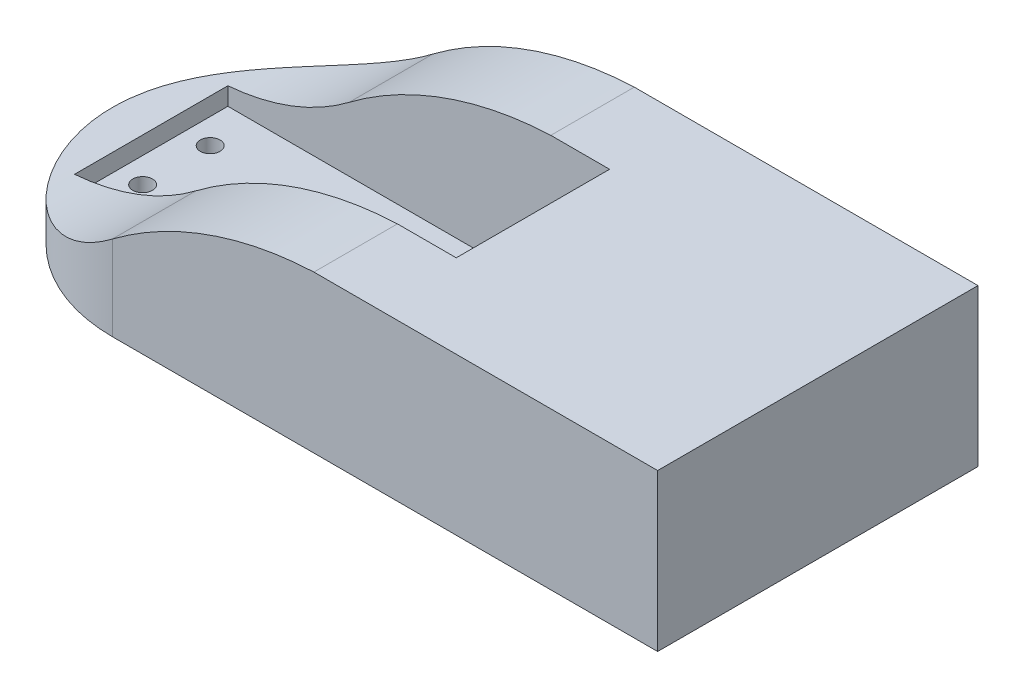
ISO-10303-21;
HEADER;
FILE_DESCRIPTION(('STEP AP214'),'2;1');
FILE_NAME('part.step','',(''),(''),'','','');
FILE_SCHEMA(('AUTOMOTIVE_DESIGN { 1 0 10303 214 1 1 1 1 }'));
ENDSEC;
DATA;
#1=APPLICATION_CONTEXT('core data for automotive mechanical design processes');
#2=APPLICATION_PROTOCOL_DEFINITION('international standard','automotive_design',2000,#1);
#3=PRODUCT_CONTEXT('',#1,'mechanical');
#4=PRODUCT('Part','Part','',(#3));
#5=PRODUCT_RELATED_PRODUCT_CATEGORY('part','',(#4));
#6=PRODUCT_DEFINITION_FORMATION('','',#4);
#7=PRODUCT_DEFINITION_CONTEXT('part definition',#1,'design');
#8=PRODUCT_DEFINITION('design','',#6,#7);
#9=PRODUCT_DEFINITION_SHAPE('','',#8);
#10=(LENGTH_UNIT() NAMED_UNIT(*) SI_UNIT(.MILLI.,.METRE.));
#11=(NAMED_UNIT(*) PLANE_ANGLE_UNIT() SI_UNIT($,.RADIAN.));
#12=(NAMED_UNIT(*) SI_UNIT($,.STERADIAN.) SOLID_ANGLE_UNIT());
#13=UNCERTAINTY_MEASURE_WITH_UNIT(LENGTH_MEASURE(1.E-05),#10,'distance_accuracy_value','');
#14=(GEOMETRIC_REPRESENTATION_CONTEXT(3) GLOBAL_UNCERTAINTY_ASSIGNED_CONTEXT((#13)) GLOBAL_UNIT_ASSIGNED_CONTEXT((#10,
#11,#12)) REPRESENTATION_CONTEXT('',''));
#15=CARTESIAN_POINT('',(0.,0.,0.));
#16=DIRECTION('',(0.,0.,1.));
#17=DIRECTION('',(1.,0.,0.));
#18=AXIS2_PLACEMENT_3D('',#15,#16,#17);
#19=CARTESIAN_POINT('',(0.,0.,0.));
#20=DIRECTION('',(0.,1.,0.));
#21=DIRECTION('',(0.,0.,1.));
#22=AXIS2_PLACEMENT_3D('',#19,#20,#21);
#23=PLANE('',#22);
#24=CARTESIAN_POINT('',(-14.1003752376238,0.,-4.95323736700255));
#25=DIRECTION('',(0.,1.,0.));
#26=DIRECTION('',(0.,0.,1.));
#27=AXIS2_PLACEMENT_3D('',#24,#25,#26);
#28=CIRCLE('',#27,1.45);
#29=CARTESIAN_POINT('',(-14.1003752376238,0.,-3.50323736700255));
#30=VERTEX_POINT('',#29);
#31=EDGE_CURVE('E332',#30,#30,#28,.T.);
#32=ORIENTED_EDGE('',*,*,#31,.T.);
#33=EDGE_LOOP('',(#32));
#34=FACE_BOUND('',#33,.T.);
#35=CARTESIAN_POINT('',(-14.1003752376238,0.,4.95625504727173));
#36=DIRECTION('',(0.,1.,0.));
#37=DIRECTION('',(0.,0.,1.));
#38=AXIS2_PLACEMENT_3D('',#35,#36,#37);
#39=CIRCLE('',#38,1.45);
#40=CARTESIAN_POINT('',(-14.1003752376238,0.,6.40625504727173));
#41=VERTEX_POINT('',#40);
#42=EDGE_CURVE('E326',#41,#41,#39,.T.);
#43=ORIENTED_EDGE('',*,*,#42,.T.);
#44=EDGE_LOOP('',(#43));
#45=FACE_BOUND('',#44,.T.);
#46=CARTESIAN_POINT('',(34.5,0.,4.94999999999989));
#47=DIRECTION('',(0.,1.,0.));
#48=DIRECTION('',(0.,0.,1.));
#49=AXIS2_PLACEMENT_3D('',#46,#47,#48);
#50=CIRCLE('',#49,1.45);
#51=CARTESIAN_POINT('',(34.5,0.,6.39999999999989));
#52=VERTEX_POINT('',#51);
#53=EDGE_CURVE('E320',#52,#52,#50,.T.);
#54=ORIENTED_EDGE('',*,*,#53,.T.);
#55=EDGE_LOOP('',(#54));
#56=FACE_BOUND('',#55,.T.);
#57=CARTESIAN_POINT('',(34.5,0.,-4.95323736700255));
#58=DIRECTION('',(0.,1.,0.));
#59=DIRECTION('',(0.,0.,1.));
#60=AXIS2_PLACEMENT_3D('',#57,#58,#59);
#61=CIRCLE('',#60,1.45);
#62=CARTESIAN_POINT('',(34.5,0.,-3.50323736700255));
#63=VERTEX_POINT('',#62);
#64=EDGE_CURVE('E313',#63,#63,#61,.T.);
#65=ORIENTED_EDGE('',*,*,#64,.T.);
#66=EDGE_LOOP('',(#65));
#67=FACE_BOUND('',#66,.T.);
#68=CARTESIAN_POINT('',(0.,0.,0.));
#69=DIRECTION('',(0.,1.,0.));
#70=DIRECTION('',(0.,0.,1.));
#71=AXIS2_PLACEMENT_3D('',#68,#69,#70);
#72=CIRCLE('',#71,23.5);
#73=CARTESIAN_POINT('',(0.,0.,-23.5));
#74=VERTEX_POINT('',#73);
#75=CARTESIAN_POINT('',(0.,0.,23.5));
#76=VERTEX_POINT('',#75);
#77=EDGE_CURVE('E128',#74,#76,#72,.T.);
#78=ORIENTED_EDGE('',*,*,#77,.F.);
#79=DIRECTION('',(1.,0.,0.));
#80=VECTOR('',#79,1.);
#81=CARTESIAN_POINT('',(0.,0.,-23.5));
#82=LINE('',#81,#80);
#83=CARTESIAN_POINT('',(80.,0.,-23.5));
#84=VERTEX_POINT('',#83);
#85=EDGE_CURVE('E110',#74,#84,#82,.T.);
#86=ORIENTED_EDGE('',*,*,#85,.T.);
#87=DIRECTION('',(0.,0.,1.));
#88=VECTOR('',#87,1.);
#89=CARTESIAN_POINT('',(80.,0.,-23.5));
#90=LINE('',#89,#88);
#91=CARTESIAN_POINT('',(80.,0.,23.5));
#92=VERTEX_POINT('',#91);
#93=EDGE_CURVE('E120',#84,#92,#90,.T.);
#94=ORIENTED_EDGE('',*,*,#93,.T.);
#95=DIRECTION('',(1.,0.,0.));
#96=VECTOR('',#95,1.);
#97=CARTESIAN_POINT('',(0.,0.,23.5));
#98=LINE('',#97,#96);
#99=EDGE_CURVE('E126',#76,#92,#98,.T.);
#100=ORIENTED_EDGE('',*,*,#99,.F.);
#101=EDGE_LOOP('',(#78,#86,#94,#100));
#102=FACE_BOUND('',#101,.T.);
#103=ADVANCED_FACE('F62',(#34,#45,#56,#67,#102),#23,.F.);
#104=CARTESIAN_POINT('',(0.,23.,0.));
#105=DIRECTION('',(0.,1.,0.));
#106=DIRECTION('',(0.,0.,1.));
#107=AXIS2_PLACEMENT_3D('',#104,#105,#106);
#108=PLANE('',#107);
#109=DIRECTION('',(0.,0.,1.));
#110=VECTOR('',#109,1.);
#111=CARTESIAN_POINT('',(29.574214856324,23.,-23.5));
#112=LINE('',#111,#110);
#113=CARTESIAN_POINT('',(29.574214856324,23.,11.2500000000001));
#114=VERTEX_POINT('',#113);
#115=CARTESIAN_POINT('',(29.574214856324,23.,23.5));
#116=VERTEX_POINT('',#115);
#117=EDGE_CURVE('E300',#114,#116,#112,.T.);
#118=ORIENTED_EDGE('',*,*,#117,.T.);
#119=DIRECTION('',(1.,0.,0.));
#120=VECTOR('',#119,1.);
#121=CARTESIAN_POINT('',(0.,23.,23.5));
#122=LINE('',#121,#120);
#123=CARTESIAN_POINT('',(80.,23.,23.5));
#124=VERTEX_POINT('',#123);
#125=EDGE_CURVE('E129',#116,#124,#122,.T.);
#126=ORIENTED_EDGE('',*,*,#125,.T.);
#127=DIRECTION('',(0.,0.,1.));
#128=VECTOR('',#127,1.);
#129=CARTESIAN_POINT('',(80.,23.,-23.5));
#130=LINE('',#129,#128);
#131=CARTESIAN_POINT('',(80.,23.,-23.5));
#132=VERTEX_POINT('',#131);
#133=EDGE_CURVE('E131',#132,#124,#130,.T.);
#134=ORIENTED_EDGE('',*,*,#133,.F.);
#135=DIRECTION('',(1.,0.,0.));
#136=VECTOR('',#135,1.);
#137=CARTESIAN_POINT('',(0.,23.,-23.5));
#138=LINE('',#137,#136);
#139=CARTESIAN_POINT('',(29.574214856324,23.,-23.5));
#140=VERTEX_POINT('',#139);
#141=EDGE_CURVE('E113',#140,#132,#138,.T.);
#142=ORIENTED_EDGE('',*,*,#141,.F.);
#143=CARTESIAN_POINT('',(29.574214856324,23.,-11.2500000000007));
#144=VERTEX_POINT('',#143);
#145=EDGE_CURVE('E302',#140,#144,#112,.T.);
#146=ORIENTED_EDGE('',*,*,#145,.T.);
#147=DIRECTION('',(-1.,0.,0.));
#148=VECTOR('',#147,1.);
#149=CARTESIAN_POINT('',(-17.8,23.,-11.250000000001));
#150=LINE('',#149,#148);
#151=CARTESIAN_POINT('',(38.2000000000001,23.,-11.2500000000004));
#152=VERTEX_POINT('',#151);
#153=EDGE_CURVE('E233',#152,#144,#150,.T.);
#154=ORIENTED_EDGE('',*,*,#153,.F.);
#155=DIRECTION('',(0.,0.,-1.));
#156=VECTOR('',#155,1.);
#157=CARTESIAN_POINT('',(38.2000000000001,23.,-11.2500000000004));
#158=LINE('',#157,#156);
#159=CARTESIAN_POINT('',(38.2000000000002,23.,11.2499999999999));
#160=VERTEX_POINT('',#159);
#161=EDGE_CURVE('E222',#160,#152,#158,.T.);
#162=ORIENTED_EDGE('',*,*,#161,.F.);
#163=DIRECTION('',(1.,0.,0.));
#164=VECTOR('',#163,1.);
#165=CARTESIAN_POINT('',(38.2000000000002,23.,11.2499999999999));
#166=LINE('',#165,#164);
#167=EDGE_CURVE('E232',#114,#160,#166,.T.);
#168=ORIENTED_EDGE('',*,*,#167,.F.);
#169=EDGE_LOOP('',(#118,#126,#134,#142,#146,#154,#162,#168));
#170=FACE_BOUND('',#169,.T.);
#171=ADVANCED_FACE('F277',(#170),#108,.T.);
#172=CARTESIAN_POINT('',(0.,23.,0.));
#173=DIRECTION('',(0.,-1.,0.));
#174=DIRECTION('',(0.,0.,-1.));
#175=AXIS2_PLACEMENT_3D('',#172,#173,#174);
#176=CYLINDRICAL_SURFACE('',#175,23.5);
#177=DIRECTION('',(0.,-1.,0.));
#178=VECTOR('',#177,1.);
#179=CARTESIAN_POINT('',(0.,23.,23.5));
#180=LINE('',#179,#178);
#181=CARTESIAN_POINT('',(0.,12.4092035172536,23.5));
#182=VERTEX_POINT('',#181);
#183=EDGE_CURVE('E135',#182,#76,#180,.T.);
#184=ORIENTED_EDGE('',*,*,#183,.F.);
#185=CARTESIAN_POINT('',(0.,12.4092035172536,23.5));
#186=CARTESIAN_POINT('',(-0.244052644575949,12.2239857633566,23.4999995457922));
#187=CARTESIAN_POINT('',(-0.490597991677809,12.042088966713,23.4961973453588));
#188=CARTESIAN_POINT('',(-0.988373755156162,11.6851323295406,23.4805271315603));
#189=CARTESIAN_POINT('',(-1.2396046489349,11.5100731913739,23.4686582918846));
#190=CARTESIAN_POINT('',(-2.00005426237437,10.9953281948611,23.4202430513505));
#191=CARTESIAN_POINT('',(-2.51578359936776,10.666261626987,23.370886995028));
#192=CARTESIAN_POINT('',(-3.56145807596274,10.0379507062078,23.2345540440406));
#193=CARTESIAN_POINT('',(-4.09142551118063,9.7387570581557,23.1475144795817));
#194=CARTESIAN_POINT('',(-5.16010152646308,9.17239327367803,22.9329504447906));
#195=CARTESIAN_POINT('',(-5.69880779587703,8.90521482384704,22.8054365159792));
#196=CARTESIAN_POINT('',(-6.78249144509834,8.40260767245476,22.5070030179749));
#197=CARTESIAN_POINT('',(-7.32748666380046,8.16734255239274,22.3358718700244));
#198=CARTESIAN_POINT('',(-8.41529279103563,7.73047972341131,21.9491695664871));
#199=CARTESIAN_POINT('',(-8.9581035081735,7.52888490443356,21.7335945998058));
#200=CARTESIAN_POINT('',(-10.0343273539135,7.15929750443181,21.2581205467449));
#201=CARTESIAN_POINT('',(-10.5677565361966,6.9912410994123,20.9983074273218));
#202=CARTESIAN_POINT('',(-11.6202189372866,6.68695594137842,20.4346956547464));
#203=CARTESIAN_POINT('',(-12.1392530898467,6.55072511967864,20.1308998625791));
#204=CARTESIAN_POINT('',(-13.1233359827985,6.31605383128535,19.5024597445631));
#205=CARTESIAN_POINT('',(-13.5896789618178,6.21570210969996,19.1805473102));
#206=CARTESIAN_POINT('',(-14.5006319097206,6.0386295577361,18.5014700872519));
#207=CARTESIAN_POINT('',(-14.9452427914974,5.96190773402492,18.1443067813456));
#208=CARTESIAN_POINT('',(-15.8093957355904,5.82939158356437,17.3965459020244));
#209=CARTESIAN_POINT('',(-16.2289148118754,5.77361620578775,17.0059184460033));
#210=CARTESIAN_POINT('',(-17.0392374705673,5.6801785212823,16.1939316096182));
#211=CARTESIAN_POINT('',(-17.430039813033,5.64251699629089,15.7725709038066));
#212=CARTESIAN_POINT('',(-18.1943945917157,5.58112964951433,14.8852200643244));
#213=CARTESIAN_POINT('',(-18.5667326437263,5.55798582329973,14.4181439224485));
#214=CARTESIAN_POINT('',(-19.2749444658622,5.52452844366282,13.4567098625482));
#215=CARTESIAN_POINT('',(-19.6108176715048,5.51421508883283,12.9623515223688));
#216=CARTESIAN_POINT('',(-20.2439772828285,5.50310820639031,11.949399101556));
#217=CARTESIAN_POINT('',(-20.5412622128209,5.50231504274185,11.4308040950974));
#218=CARTESIAN_POINT('',(-21.0954540776294,5.50714014613263,10.3724951174585));
#219=CARTESIAN_POINT('',(-21.3523592998431,5.51275868502443,9.83278025174513));
#220=CARTESIAN_POINT('',(-21.8432082173504,5.52817088531594,8.69139932155585));
#221=CARTESIAN_POINT('',(-22.0736637164661,5.53826295971864,8.08823403874654));
#222=CARTESIAN_POINT('',(-22.484175661718,5.55952678664426,6.86499136421877));
#223=CARTESIAN_POINT('',(-22.6642296861945,5.57069859101071,6.2449131614489));
#224=CARTESIAN_POINT('',(-22.9727410055273,5.59160840398454,4.99194165137468));
#225=CARTESIAN_POINT('',(-23.1011920585437,5.60134623905035,4.35904680350241));
#226=CARTESIAN_POINT('',(-23.3055876859054,5.61753607725399,3.08479587015623));
#227=CARTESIAN_POINT('',(-23.3815323143304,5.62398808377611,2.44343979339778));
#228=CARTESIAN_POINT('',(-23.4815499007328,5.63258662174588,1.14149450616259));
#229=CARTESIAN_POINT('',(-23.5043625717932,5.6346284644245,0.480807380510978));
#230=CARTESIAN_POINT('',(-23.4942637393949,5.63373984543253,-0.84014686057953));
#231=CARTESIAN_POINT('',(-23.4613510764391,5.63080928029926,-1.50041396699297));
#232=CARTESIAN_POINT('',(-23.3400368659146,5.62048809728251,-2.81584444414135));
#233=CARTESIAN_POINT('',(-23.2516311397023,5.61309714353211,-3.47100742677273));
#234=CARTESIAN_POINT('',(-23.0199673454929,5.59521326195164,-4.77151485860004));
#235=CARTESIAN_POINT('',(-22.8767094293147,5.58472034270716,-5.41685933496634));
#236=CARTESIAN_POINT('',(-22.5367459403205,5.56280716160676,-6.69173569443185));
#237=CARTESIAN_POINT('',(-22.3401615713242,5.55138904338021,-7.32129994162066));
#238=CARTESIAN_POINT('',(-21.8947763024631,5.53044506866777,-8.56171838935722));
#239=CARTESIAN_POINT('',(-21.6459751639504,5.52091922083056,-9.17257250437884));
#240=CARTESIAN_POINT('',(-21.097836521898,5.50720512588301,-10.3713923589628));
#241=CARTESIAN_POINT('',(-20.7984888378525,5.50301795548346,-10.9593534582615));
#242=CARTESIAN_POINT('',(-20.1514236305978,5.50393063887138,-12.1080406040605));
#243=CARTESIAN_POINT('',(-19.8037063181084,5.50903045220175,-12.668766769194));
#244=CARTESIAN_POINT('',(-19.0629300602186,5.53282174989347,-13.7582000882515));
#245=CARTESIAN_POINT('',(-18.6699242460123,5.55149744130083,-14.2869436743192));
#246=CARTESIAN_POINT('',(-17.8414055405478,5.60695311096591,-15.3090492506783));
#247=CARTESIAN_POINT('',(-17.4058923981988,5.64373319617143,-15.8024110319395));
#248=CARTESIAN_POINT('',(-16.4965116482134,5.73994613925311,-16.7495013554313));
#249=CARTESIAN_POINT('',(-16.0226677508346,5.79936507654503,-17.2032540428918));
#250=CARTESIAN_POINT('',(-15.0410971440629,5.94526096637331,-18.0677327674196));
#251=CARTESIAN_POINT('',(-14.5333732033237,6.03173571005309,-18.4784623132764));
#252=CARTESIAN_POINT('',(-13.521989972559,6.22939046442161,-19.2296033152978));
#253=CARTESIAN_POINT('',(-13.0200306649007,6.33870615924705,-19.5727957473557));
#254=CARTESIAN_POINT('',(-11.9964634698203,6.58738489902557,-20.2163362011264));
#255=CARTESIAN_POINT('',(-11.4748563903347,6.72674670956237,-20.516685982147));
#256=CARTESIAN_POINT('',(-10.4179423239297,7.03751564172173,-21.07304068772));
#257=CARTESIAN_POINT('',(-9.88263960368225,7.20891288562519,-21.3290592344958));
#258=CARTESIAN_POINT('',(-8.80428637082964,7.58500216872554,-21.7963253740602));
#259=CARTESIAN_POINT('',(-8.26123634011718,7.78969214523803,-22.0075757386401));
#260=CARTESIAN_POINT('',(-7.2108702624353,8.21749561023853,-22.3727742399529));
#261=CARTESIAN_POINT('',(-6.70366165073587,8.43837812988664,-22.5296615176331));
#262=CARTESIAN_POINT('',(-5.6924776429862,8.90900830341335,-22.8061491689884));
#263=CARTESIAN_POINT('',(-5.18850238263215,9.15875716048811,-22.9257479876509));
#264=CARTESIAN_POINT('',(-4.18832494010638,9.68615476753456,-23.1293832068404));
#265=CARTESIAN_POINT('',(-3.69212002652962,9.96379344719434,-23.2134323867359));
#266=CARTESIAN_POINT('',(-2.71119105745704,10.5457411253922,-23.3483288257204));
#267=CARTESIAN_POINT('',(-2.22646335329215,10.8500414994075,-23.3991867768584));
#268=CARTESIAN_POINT('',(-1.45113703294093,11.3646555577611,-23.457056892169));
#269=CARTESIAN_POINT('',(-1.15606491844249,11.5672952438251,-23.4733646553653));
#270=CARTESIAN_POINT('',(-0.572866660613985,11.9815338665914,-23.4948245370496));
#271=CARTESIAN_POINT('',(-0.284726279672556,12.193111437939,-23.5000018765049));
#272=CARTESIAN_POINT('',(0.,12.4092035172536,-23.5));
#273=B_SPLINE_CURVE_WITH_KNOTS('',3,(#185,#186,#187,#188,#189,#190,#191,#192,#193,#194,#195,
#196,#197,#198,#199,#200,#201,#202,#203,#204,#205,#206,#207,#208,#209,#210,#211,#212,#213,#214,
#215,#216,#217,#218,#219,#220,#221,#222,#223,#224,#225,#226,#227,#228,#229,#230,#231,#232,#233,
#234,#235,#236,#237,#238,#239,#240,#241,#242,#243,#244,#245,#246,#247,#248,#249,#250,#251,#252,
#253,#254,#255,#256,#257,#258,#259,#260,#261,#262,#263,#264,#265,#266,#267,#268,#269,#270,#271,
#272),.UNSPECIFIED.,.F.,.F.,(4,2,2,2,2,2,2,2,2,2,2,2,2,2,2,2,2,2,2,2,2,2,2,2,2,2,2,2,2,2,2,2,2,
2,2,2,2,2,2,2,2,2,2,4),(0.,0.919030757575344,1.83815567077144,3.67733058596115,5.5195759727964,
7.36134194122921,9.2122178882149,11.0632526154184,12.910730488269,14.7580882403184,
16.4825363009859,18.2069118609367,19.9328436220555,21.6588498623274,23.4502444998257,
25.2416668645031,27.0331577163899,28.8247245293005,30.7598146031867,32.6949976371596,
34.630414678362,36.56582972615,38.5467047634009,40.5276210179411,42.5086864539377,
44.4897464068108,46.46634086826,48.4429443635979,50.4199464396496,52.3969399032664,
54.3716371837288,56.3463461294305,58.3198427851579,60.293178365142,62.1441570914022,
63.9950597864362,65.8453927177966,67.6956110535746,69.4187511778386,71.1419631513199,
72.8645551377458,74.586591943127,75.6612422254041,76.7334548275522),.UNSPECIFIED.);
#274=CARTESIAN_POINT('',(0.,12.4092035172536,-23.5));
#275=VERTEX_POINT('',#274);
#276=EDGE_CURVE('E165',#182,#275,#273,.T.);
#277=ORIENTED_EDGE('',*,*,#276,.T.);
#278=DIRECTION('',(0.,-1.,0.));
#279=VECTOR('',#278,1.);
#280=CARTESIAN_POINT('',(0.,23.,-23.5));
#281=LINE('',#280,#279);
#282=EDGE_CURVE('E86',#275,#74,#281,.T.);
#283=ORIENTED_EDGE('',*,*,#282,.T.);
#284=ORIENTED_EDGE('',*,*,#77,.T.);
#285=EDGE_LOOP('',(#184,#277,#283,#284));
#286=FACE_BOUND('',#285,.T.);
#287=ADVANCED_FACE('F161',(#286),#176,.T.);
#288=CARTESIAN_POINT('',(80.,23.,-23.5));
#289=DIRECTION('',(1.,0.,0.));
#290=DIRECTION('',(0.,0.,-1.));
#291=AXIS2_PLACEMENT_3D('',#288,#289,#290);
#292=PLANE('',#291);
#293=ORIENTED_EDGE('',*,*,#93,.F.);
#294=DIRECTION('',(0.,-1.,0.));
#295=VECTOR('',#294,1.);
#296=CARTESIAN_POINT('',(80.,23.,-23.5));
#297=LINE('',#296,#295);
#298=EDGE_CURVE('E105',#132,#84,#297,.T.);
#299=ORIENTED_EDGE('',*,*,#298,.F.);
#300=ORIENTED_EDGE('',*,*,#133,.T.);
#301=DIRECTION('',(0.,-1.,0.));
#302=VECTOR('',#301,1.);
#303=CARTESIAN_POINT('',(80.,23.,23.5));
#304=LINE('',#303,#302);
#305=EDGE_CURVE('E117',#124,#92,#304,.T.);
#306=ORIENTED_EDGE('',*,*,#305,.T.);
#307=EDGE_LOOP('',(#293,#299,#300,#306));
#308=FACE_BOUND('',#307,.T.);
#309=ADVANCED_FACE('F121',(#308),#292,.T.);
#310=CARTESIAN_POINT('',(0.,23.,-23.5));
#311=DIRECTION('',(0.,0.,-1.));
#312=DIRECTION('',(-1.,0.,0.));
#313=AXIS2_PLACEMENT_3D('',#310,#311,#312);
#314=PLANE('',#313);
#315=CARTESIAN_POINT('',(31.7758941833863,-29.7356479398533,-23.5));
#316=DIRECTION('',(0.,0.,-1.));
#317=DIRECTION('',(-1.,0.,0.));
#318=AXIS2_PLACEMENT_3D('',#315,#316,#317);
#319=CIRCLE('',#318,52.7815872771497);
#320=EDGE_CURVE('E303',#275,#140,#319,.T.);
#321=ORIENTED_EDGE('',*,*,#320,.T.);
#322=ORIENTED_EDGE('',*,*,#141,.T.);
#323=ORIENTED_EDGE('',*,*,#298,.T.);
#324=ORIENTED_EDGE('',*,*,#85,.F.);
#325=ORIENTED_EDGE('',*,*,#282,.F.);
#326=EDGE_LOOP('',(#321,#322,#323,#324,#325));
#327=FACE_BOUND('',#326,.T.);
#328=ADVANCED_FACE('F108',(#327),#314,.T.);
#329=CARTESIAN_POINT('',(0.,23.,23.5));
#330=DIRECTION('',(0.,0.,-1.));
#331=DIRECTION('',(-1.,0.,0.));
#332=AXIS2_PLACEMENT_3D('',#329,#330,#331);
#333=PLANE('',#332);
#334=ORIENTED_EDGE('',*,*,#125,.F.);
#335=CARTESIAN_POINT('',(31.7758941833863,-29.7356479398533,23.5));
#336=DIRECTION('',(0.,0.,-1.));
#337=DIRECTION('',(-1.,0.,0.));
#338=AXIS2_PLACEMENT_3D('',#335,#336,#337);
#339=CIRCLE('',#338,52.7815872771497);
#340=EDGE_CURVE('E298',#182,#116,#339,.T.);
#341=ORIENTED_EDGE('',*,*,#340,.F.);
#342=ORIENTED_EDGE('',*,*,#183,.T.);
#343=ORIENTED_EDGE('',*,*,#99,.T.);
#344=ORIENTED_EDGE('',*,*,#305,.F.);
#345=EDGE_LOOP('',(#334,#341,#342,#343,#344));
#346=FACE_BOUND('',#345,.T.);
#347=ADVANCED_FACE('F64',(#346),#333,.F.);
#348=CARTESIAN_POINT('',(-17.8,-60.3510563287841,-11.250000000001));
#349=DIRECTION('',(0.,0.,-1.));
#350=DIRECTION('',(-1.,0.,0.));
#351=AXIS2_PLACEMENT_3D('',#348,#349,#350);
#352=PLANE('',#351);
#353=ORIENTED_EDGE('',*,*,#153,.T.);
#354=CARTESIAN_POINT('',(31.7758941833863,-29.7356479398533,-11.2500000000005));
#355=DIRECTION('',(0.,0.,-1.));
#356=DIRECTION('',(-1.,0.,0.));
#357=AXIS2_PLACEMENT_3D('',#354,#355,#356);
#358=CIRCLE('',#357,52.7815872771497);
#359=CARTESIAN_POINT('',(0.,12.4092035172536,-11.2500000000014));
#360=VERTEX_POINT('',#359);
#361=EDGE_CURVE('E235',#144,#360,#358,.F.);
#362=ORIENTED_EDGE('',*,*,#361,.T.);
#363=CARTESIAN_POINT('',(-20.5227613376453,39.4514129373195,-11.250000000001));
#364=DIRECTION('',(0.,0.,-1.));
#365=DIRECTION('',(-1.,0.,0.));
#366=AXIS2_PLACEMENT_3D('',#363,#364,#365);
#367=CIRCLE('',#366,33.9479722993973);
#368=CARTESIAN_POINT('',(-17.8,5.61280489947504,-11.250000000001));
#369=VERTEX_POINT('',#368);
#370=EDGE_CURVE('E247',#360,#369,#367,.T.);
#371=ORIENTED_EDGE('',*,*,#370,.T.);
#372=DIRECTION('',(0.,1.,0.));
#373=VECTOR('',#372,1.);
#374=CARTESIAN_POINT('',(-17.8,-60.3510563287841,-11.250000000001));
#375=LINE('',#374,#373);
#376=CARTESIAN_POINT('',(-17.8,3.,-11.250000000001));
#377=VERTEX_POINT('',#376);
#378=EDGE_CURVE('E159',#377,#369,#375,.T.);
#379=ORIENTED_EDGE('',*,*,#378,.F.);
#380=DIRECTION('',(1.,0.,0.));
#381=VECTOR('',#380,1.);
#382=CARTESIAN_POINT('',(-17.8,3.,-11.250000000001));
#383=LINE('',#382,#381);
#384=CARTESIAN_POINT('',(38.2000000000001,3.,-11.2500000000004));
#385=VERTEX_POINT('',#384);
#386=EDGE_CURVE('E150',#377,#385,#383,.T.);
#387=ORIENTED_EDGE('',*,*,#386,.T.);
#388=DIRECTION('',(0.,1.,0.));
#389=VECTOR('',#388,1.);
#390=CARTESIAN_POINT('',(38.2000000000001,-60.3510563287841,-11.2500000000004));
#391=LINE('',#390,#389);
#392=EDGE_CURVE('E209',#385,#152,#391,.T.);
#393=ORIENTED_EDGE('',*,*,#392,.T.);
#394=EDGE_LOOP('',(#353,#362,#371,#379,#387,#393));
#395=FACE_BOUND('',#394,.T.);
#396=ADVANCED_FACE('F207',(#395),#352,.F.);
#397=CARTESIAN_POINT('',(38.2000000000001,-60.3510563287841,-11.2500000000004));
#398=DIRECTION('',(1.,0.,0.));
#399=DIRECTION('',(0.,0.,-1.));
#400=AXIS2_PLACEMENT_3D('',#397,#398,#399);
#401=PLANE('',#400);
#402=DIRECTION('',(0.,0.,1.));
#403=VECTOR('',#402,1.);
#404=CARTESIAN_POINT('',(38.2000000000001,3.,-11.2500000000004));
#405=LINE('',#404,#403);
#406=CARTESIAN_POINT('',(38.2000000000002,3.,11.2499999999999));
#407=VERTEX_POINT('',#406);
#408=EDGE_CURVE('E156',#385,#407,#405,.T.);
#409=ORIENTED_EDGE('',*,*,#408,.T.);
#410=DIRECTION('',(0.,1.,0.));
#411=VECTOR('',#410,1.);
#412=CARTESIAN_POINT('',(38.2000000000002,-60.3510563287841,11.2499999999999));
#413=LINE('',#412,#411);
#414=EDGE_CURVE('E224',#407,#160,#413,.T.);
#415=ORIENTED_EDGE('',*,*,#414,.T.);
#416=ORIENTED_EDGE('',*,*,#161,.T.);
#417=ORIENTED_EDGE('',*,*,#392,.F.);
#418=EDGE_LOOP('',(#409,#415,#416,#417));
#419=FACE_BOUND('',#418,.T.);
#420=ADVANCED_FACE('F220',(#419),#401,.F.);
#421=CARTESIAN_POINT('',(38.2000000000002,-60.3510563287841,11.2499999999999));
#422=DIRECTION('',(0.,0.,1.));
#423=DIRECTION('',(1.,0.,0.));
#424=AXIS2_PLACEMENT_3D('',#421,#422,#423);
#425=PLANE('',#424);
#426=CARTESIAN_POINT('',(-20.5227613376453,39.4514129373195,11.2500000000002));
#427=DIRECTION('',(0.,0.,1.));
#428=DIRECTION('',(1.,0.,0.));
#429=AXIS2_PLACEMENT_3D('',#426,#427,#428);
#430=CIRCLE('',#429,33.9479722993973);
#431=CARTESIAN_POINT('',(-17.8,5.61280489947504,11.2500000000001));
#432=VERTEX_POINT('',#431);
#433=CARTESIAN_POINT('',(0.,12.4092035172536,11.25));
#434=VERTEX_POINT('',#433);
#435=EDGE_CURVE('E77',#432,#434,#430,.T.);
#436=ORIENTED_EDGE('',*,*,#435,.T.);
#437=CARTESIAN_POINT('',(31.7758941833863,-29.7356479398533,11.25));
#438=DIRECTION('',(0.,0.,1.));
#439=DIRECTION('',(1.,0.,0.));
#440=AXIS2_PLACEMENT_3D('',#437,#438,#439);
#441=CIRCLE('',#440,52.7815872771497);
#442=EDGE_CURVE('E13',#434,#114,#441,.F.);
#443=ORIENTED_EDGE('',*,*,#442,.T.);
#444=ORIENTED_EDGE('',*,*,#167,.T.);
#445=ORIENTED_EDGE('',*,*,#414,.F.);
#446=DIRECTION('',(-1.,0.,0.));
#447=VECTOR('',#446,1.);
#448=CARTESIAN_POINT('',(38.2000000000002,3.,11.2499999999999));
#449=LINE('',#448,#447);
#450=CARTESIAN_POINT('',(-17.8,3.,11.2500000000001));
#451=VERTEX_POINT('',#450);
#452=EDGE_CURVE('E215',#407,#451,#449,.T.);
#453=ORIENTED_EDGE('',*,*,#452,.T.);
#454=DIRECTION('',(0.,1.,0.));
#455=VECTOR('',#454,1.);
#456=CARTESIAN_POINT('',(-17.8,-60.3510563287841,11.2500000000001));
#457=LINE('',#456,#455);
#458=EDGE_CURVE('E227',#451,#432,#457,.T.);
#459=ORIENTED_EDGE('',*,*,#458,.T.);
#460=EDGE_LOOP('',(#436,#443,#444,#445,#453,#459));
#461=FACE_BOUND('',#460,.T.);
#462=ADVANCED_FACE('F270',(#461),#425,.F.);
#463=CARTESIAN_POINT('',(-17.8,-60.3510563287841,11.2500000000001));
#464=DIRECTION('',(-1.,0.,0.));
#465=DIRECTION('',(0.,0.,1.));
#466=AXIS2_PLACEMENT_3D('',#463,#464,#465);
#467=PLANE('',#466);
#468=ORIENTED_EDGE('',*,*,#378,.T.);
#469=DIRECTION('',(0.,0.,1.));
#470=VECTOR('',#469,1.);
#471=CARTESIAN_POINT('',(-17.8,5.61280489947504,-23.5));
#472=LINE('',#471,#470);
#473=EDGE_CURVE('E70',#369,#432,#472,.T.);
#474=ORIENTED_EDGE('',*,*,#473,.T.);
#475=ORIENTED_EDGE('',*,*,#458,.F.);
#476=DIRECTION('',(0.,0.,-1.));
#477=VECTOR('',#476,1.);
#478=CARTESIAN_POINT('',(-17.8,3.,11.2500000000001));
#479=LINE('',#478,#477);
#480=EDGE_CURVE('E148',#451,#377,#479,.T.);
#481=ORIENTED_EDGE('',*,*,#480,.T.);
#482=EDGE_LOOP('',(#468,#474,#475,#481));
#483=FACE_BOUND('',#482,.T.);
#484=ADVANCED_FACE('F266',(#483),#467,.F.);
#485=CARTESIAN_POINT('',(0.,3.,0.));
#486=DIRECTION('',(0.,1.,0.));
#487=DIRECTION('',(0.,0.,1.));
#488=AXIS2_PLACEMENT_3D('',#485,#486,#487);
#489=PLANE('',#488);
#490=CARTESIAN_POINT('',(-14.1003752376238,3.,-4.95323736700255));
#491=DIRECTION('',(0.,1.,0.));
#492=DIRECTION('',(0.,0.,1.));
#493=AXIS2_PLACEMENT_3D('',#490,#491,#492);
#494=CIRCLE('',#493,1.45);
#495=CARTESIAN_POINT('',(-14.1003752376238,3.,-3.50323736700255));
#496=VERTEX_POINT('',#495);
#497=EDGE_CURVE('E334',#496,#496,#494,.T.);
#498=ORIENTED_EDGE('',*,*,#497,.F.);
#499=EDGE_LOOP('',(#498));
#500=FACE_BOUND('',#499,.T.);
#501=CARTESIAN_POINT('',(-14.1003752376238,3.,4.95625504727173));
#502=DIRECTION('',(0.,1.,0.));
#503=DIRECTION('',(0.,0.,1.));
#504=AXIS2_PLACEMENT_3D('',#501,#502,#503);
#505=CIRCLE('',#504,1.45);
#506=CARTESIAN_POINT('',(-14.1003752376238,3.,6.40625504727173));
#507=VERTEX_POINT('',#506);
#508=EDGE_CURVE('E329',#507,#507,#505,.T.);
#509=ORIENTED_EDGE('',*,*,#508,.F.);
#510=EDGE_LOOP('',(#509));
#511=FACE_BOUND('',#510,.T.);
#512=CARTESIAN_POINT('',(34.5,3.,4.94999999999989));
#513=DIRECTION('',(0.,1.,0.));
#514=DIRECTION('',(0.,0.,1.));
#515=AXIS2_PLACEMENT_3D('',#512,#513,#514);
#516=CIRCLE('',#515,1.45);
#517=CARTESIAN_POINT('',(34.5,3.,6.39999999999989));
#518=VERTEX_POINT('',#517);
#519=EDGE_CURVE('E323',#518,#518,#516,.T.);
#520=ORIENTED_EDGE('',*,*,#519,.F.);
#521=EDGE_LOOP('',(#520));
#522=FACE_BOUND('',#521,.T.);
#523=CARTESIAN_POINT('',(34.5,3.,-4.95323736700255));
#524=DIRECTION('',(0.,1.,0.));
#525=DIRECTION('',(0.,0.,1.));
#526=AXIS2_PLACEMENT_3D('',#523,#524,#525);
#527=CIRCLE('',#526,1.45);
#528=CARTESIAN_POINT('',(34.5,3.,-3.50323736700255));
#529=VERTEX_POINT('',#528);
#530=EDGE_CURVE('E315',#529,#529,#527,.T.);
#531=ORIENTED_EDGE('',*,*,#530,.F.);
#532=EDGE_LOOP('',(#531));
#533=FACE_BOUND('',#532,.T.);
#534=ORIENTED_EDGE('',*,*,#386,.F.);
#535=ORIENTED_EDGE('',*,*,#480,.F.);
#536=ORIENTED_EDGE('',*,*,#452,.F.);
#537=ORIENTED_EDGE('',*,*,#408,.F.);
#538=EDGE_LOOP('',(#534,#535,#536,#537));
#539=FACE_BOUND('',#538,.T.);
#540=ADVANCED_FACE('F214',(#500,#511,#522,#533,#539),#489,.T.);
#541=CARTESIAN_POINT('',(31.7758941833863,-29.7356479398533,-23.5));
#542=DIRECTION('',(0.,0.,1.));
#543=DIRECTION('',(1.,0.,0.));
#544=AXIS2_PLACEMENT_3D('',#541,#542,#543);
#545=CYLINDRICAL_SURFACE('',#544,52.7815872771497);
#546=ORIENTED_EDGE('',*,*,#145,.F.);
#547=ORIENTED_EDGE('',*,*,#320,.F.);
#548=DIRECTION('',(0.,0.,1.));
#549=VECTOR('',#548,1.);
#550=CARTESIAN_POINT('',(0.,12.4092035172536,-23.5));
#551=LINE('',#550,#549);
#552=EDGE_CURVE('E309',#275,#360,#551,.T.);
#553=ORIENTED_EDGE('',*,*,#552,.T.);
#554=ORIENTED_EDGE('',*,*,#361,.F.);
#555=EDGE_LOOP('',(#546,#547,#553,#554));
#556=FACE_BOUND('',#555,.T.);
#557=ADVANCED_FACE('F260',(#556),#545,.T.);
#558=EDGE_CURVE('E306',#434,#182,#551,.T.);
#559=ORIENTED_EDGE('',*,*,#558,.T.);
#560=ORIENTED_EDGE('',*,*,#340,.T.);
#561=ORIENTED_EDGE('',*,*,#117,.F.);
#562=ORIENTED_EDGE('',*,*,#442,.F.);
#563=EDGE_LOOP('',(#559,#560,#561,#562));
#564=FACE_BOUND('',#563,.T.);
#565=ADVANCED_FACE('F258',(#564),#545,.T.);
#566=CARTESIAN_POINT('',(-20.5227613376453,39.4514129373195,-23.5));
#567=DIRECTION('',(0.,0.,1.));
#568=DIRECTION('',(1.,0.,0.));
#569=AXIS2_PLACEMENT_3D('',#566,#567,#568);
#570=CYLINDRICAL_SURFACE('',#569,33.9479722993973);
#571=ORIENTED_EDGE('',*,*,#558,.F.);
#572=ORIENTED_EDGE('',*,*,#435,.F.);
#573=ORIENTED_EDGE('',*,*,#473,.F.);
#574=ORIENTED_EDGE('',*,*,#370,.F.);
#575=ORIENTED_EDGE('',*,*,#552,.F.);
#576=ORIENTED_EDGE('',*,*,#276,.F.);
#577=EDGE_LOOP('',(#571,#572,#573,#574,#575,#576));
#578=FACE_BOUND('',#577,.T.);
#579=ADVANCED_FACE('F252',(#578),#570,.F.);
#580=CARTESIAN_POINT('',(34.5,3.,-4.95323736700255));
#581=DIRECTION('',(0.,1.,0.));
#582=DIRECTION('',(0.,0.,1.));
#583=AXIS2_PLACEMENT_3D('',#580,#581,#582);
#584=CYLINDRICAL_SURFACE('',#583,1.45);
#585=ORIENTED_EDGE('',*,*,#64,.F.);
#586=EDGE_LOOP('',(#585));
#587=FACE_BOUND('',#586,.T.);
#588=ORIENTED_EDGE('',*,*,#530,.T.);
#589=EDGE_LOOP('',(#588));
#590=FACE_BOUND('',#589,.T.);
#591=ADVANCED_FACE('F257',(#587,#590),#584,.F.);
#592=CARTESIAN_POINT('',(34.5,3.,4.94999999999989));
#593=DIRECTION('',(0.,1.,0.));
#594=DIRECTION('',(0.,0.,1.));
#595=AXIS2_PLACEMENT_3D('',#592,#593,#594);
#596=CYLINDRICAL_SURFACE('',#595,1.45);
#597=ORIENTED_EDGE('',*,*,#53,.F.);
#598=EDGE_LOOP('',(#597));
#599=FACE_BOUND('',#598,.T.);
#600=ORIENTED_EDGE('',*,*,#519,.T.);
#601=EDGE_LOOP('',(#600));
#602=FACE_BOUND('',#601,.T.);
#603=ADVANCED_FACE('F347',(#599,#602),#596,.F.);
#604=CARTESIAN_POINT('',(-14.1003752376238,3.,4.95625504727173));
#605=DIRECTION('',(0.,1.,0.));
#606=DIRECTION('',(0.,0.,1.));
#607=AXIS2_PLACEMENT_3D('',#604,#605,#606);
#608=CYLINDRICAL_SURFACE('',#607,1.45);
#609=ORIENTED_EDGE('',*,*,#42,.F.);
#610=EDGE_LOOP('',(#609));
#611=FACE_BOUND('',#610,.T.);
#612=ORIENTED_EDGE('',*,*,#508,.T.);
#613=EDGE_LOOP('',(#612));
#614=FACE_BOUND('',#613,.T.);
#615=ADVANCED_FACE('F352',(#611,#614),#608,.F.);
#616=CARTESIAN_POINT('',(-14.1003752376238,3.,-4.95323736700255));
#617=DIRECTION('',(0.,1.,0.));
#618=DIRECTION('',(0.,0.,1.));
#619=AXIS2_PLACEMENT_3D('',#616,#617,#618);
#620=CYLINDRICAL_SURFACE('',#619,1.45);
#621=ORIENTED_EDGE('',*,*,#31,.F.);
#622=EDGE_LOOP('',(#621));
#623=FACE_BOUND('',#622,.T.);
#624=ORIENTED_EDGE('',*,*,#497,.T.);
#625=EDGE_LOOP('',(#624));
#626=FACE_BOUND('',#625,.T.);
#627=ADVANCED_FACE('F338',(#623,#626),#620,.F.);
#628=CLOSED_SHELL('',(#103,#171,#287,#309,#328,#347,#396,#420,#462,#484,#540,#557,#565,#579,
#591,#603,#615,#627));
#629=MANIFOLD_SOLID_BREP('B2',#628);
#630=ADVANCED_BREP_SHAPE_REPRESENTATION('',(#18,#629),#14);
#631=SHAPE_DEFINITION_REPRESENTATION(#9,#630);
ENDSEC;
END-ISO-10303-21;
